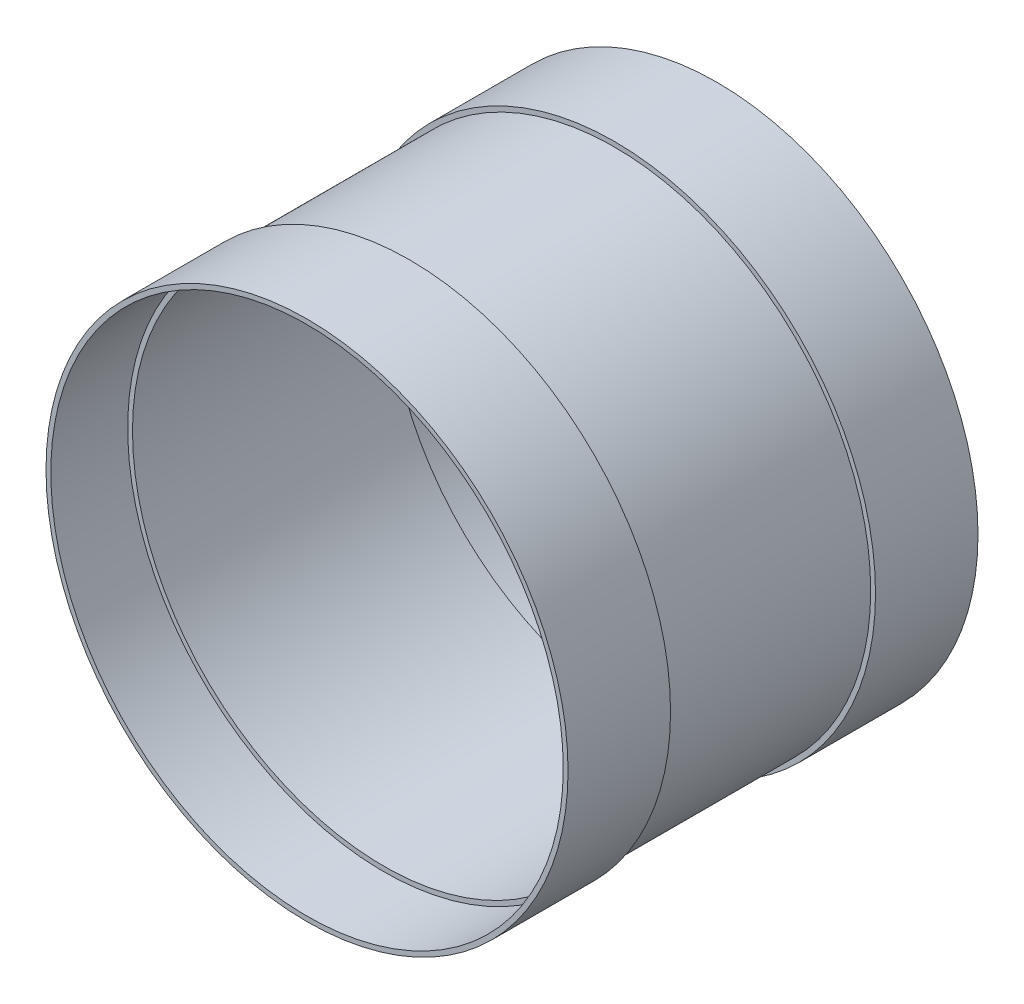
ISO-10303-21;
HEADER;
FILE_DESCRIPTION(('STEP AP214'),'2;1');
FILE_NAME('part.step','',(''),(''),'','','');
FILE_SCHEMA(('AUTOMOTIVE_DESIGN { 1 0 10303 214 1 1 1 1 }'));
ENDSEC;
DATA;
#1=APPLICATION_CONTEXT('core data for automotive mechanical design processes');
#2=APPLICATION_PROTOCOL_DEFINITION('international standard','automotive_design',2000,#1);
#3=PRODUCT_CONTEXT('',#1,'mechanical');
#4=PRODUCT('Part','Part','',(#3));
#5=PRODUCT_RELATED_PRODUCT_CATEGORY('part','',(#4));
#6=PRODUCT_DEFINITION_FORMATION('','',#4);
#7=PRODUCT_DEFINITION_CONTEXT('part definition',#1,'design');
#8=PRODUCT_DEFINITION('design','',#6,#7);
#9=PRODUCT_DEFINITION_SHAPE('','',#8);
#10=(LENGTH_UNIT() NAMED_UNIT(*) SI_UNIT(.MILLI.,.METRE.));
#11=(NAMED_UNIT(*) PLANE_ANGLE_UNIT() SI_UNIT($,.RADIAN.));
#12=(NAMED_UNIT(*) SI_UNIT($,.STERADIAN.) SOLID_ANGLE_UNIT());
#13=UNCERTAINTY_MEASURE_WITH_UNIT(LENGTH_MEASURE(1.E-05),#10,'distance_accuracy_value','');
#14=(GEOMETRIC_REPRESENTATION_CONTEXT(3) GLOBAL_UNCERTAINTY_ASSIGNED_CONTEXT((#13)) GLOBAL_UNIT_ASSIGNED_CONTEXT((#10,
#11,#12)) REPRESENTATION_CONTEXT('',''));
#15=CARTESIAN_POINT('',(0.,0.,0.));
#16=DIRECTION('',(0.,0.,1.));
#17=DIRECTION('',(1.,0.,0.));
#18=AXIS2_PLACEMENT_3D('',#15,#16,#17);
#19=CARTESIAN_POINT('',(0.,249.2375,127.));
#20=DIRECTION('',(0.,0.,-1.));
#21=DIRECTION('',(-1.,0.,0.));
#22=AXIS2_PLACEMENT_3D('',#19,#20,#21);
#23=PLANE('',#22);
#24=CARTESIAN_POINT('',(0.,0.,127.));
#25=DIRECTION('',(0.,0.,1.));
#26=DIRECTION('',(1.,0.,0.));
#27=AXIS2_PLACEMENT_3D('',#24,#25,#26);
#28=CIRCLE('',#27,249.2375);
#29=CARTESIAN_POINT('',(249.2375,0.,127.));
#30=VERTEX_POINT('',#29);
#31=EDGE_CURVE('E73',#30,#30,#28,.T.);
#32=ORIENTED_EDGE('',*,*,#31,.F.);
#33=EDGE_LOOP('',(#32));
#34=FACE_BOUND('',#33,.T.);
#35=CARTESIAN_POINT('',(0.,0.,127.));
#36=DIRECTION('',(0.,0.,1.));
#37=DIRECTION('',(1.,0.,0.));
#38=AXIS2_PLACEMENT_3D('',#35,#36,#37);
#39=CIRCLE('',#38,254.);
#40=CARTESIAN_POINT('',(254.,0.,127.));
#41=VERTEX_POINT('',#40);
#42=EDGE_CURVE('E11',#41,#41,#39,.T.);
#43=ORIENTED_EDGE('',*,*,#42,.T.);
#44=EDGE_LOOP('',(#43));
#45=FACE_BOUND('',#44,.T.);
#46=ADVANCED_FACE('F52',(#34,#45),#23,.F.);
#47=CARTESIAN_POINT('',(0.,0.,0.));
#48=DIRECTION('',(0.,0.,1.));
#49=DIRECTION('',(1.,0.,0.));
#50=AXIS2_PLACEMENT_3D('',#47,#48,#49);
#51=CYLINDRICAL_SURFACE('',#50,254.);
#52=ORIENTED_EDGE('',*,*,#42,.F.);
#53=EDGE_LOOP('',(#52));
#54=FACE_BOUND('',#53,.T.);
#55=CARTESIAN_POINT('',(0.,0.,-127.));
#56=DIRECTION('',(0.,0.,1.));
#57=DIRECTION('',(1.,0.,0.));
#58=AXIS2_PLACEMENT_3D('',#55,#56,#57);
#59=CIRCLE('',#58,254.);
#60=CARTESIAN_POINT('',(254.,0.,-127.));
#61=VERTEX_POINT('',#60);
#62=EDGE_CURVE('E59',#61,#61,#59,.T.);
#63=ORIENTED_EDGE('',*,*,#62,.T.);
#64=EDGE_LOOP('',(#63));
#65=FACE_BOUND('',#64,.T.);
#66=ADVANCED_FACE('F85',(#54,#65),#51,.T.);
#67=CARTESIAN_POINT('',(0.,249.2375,-127.));
#68=DIRECTION('',(0.,0.,1.));
#69=DIRECTION('',(1.,0.,0.));
#70=AXIS2_PLACEMENT_3D('',#67,#68,#69);
#71=PLANE('',#70);
#72=ORIENTED_EDGE('',*,*,#62,.F.);
#73=EDGE_LOOP('',(#72));
#74=FACE_BOUND('',#73,.T.);
#75=CARTESIAN_POINT('',(0.,0.,-127.));
#76=DIRECTION('',(0.,0.,1.));
#77=DIRECTION('',(1.,0.,0.));
#78=AXIS2_PLACEMENT_3D('',#75,#76,#77);
#79=CIRCLE('',#78,249.2375);
#80=CARTESIAN_POINT('',(249.2375,0.,-127.));
#81=VERTEX_POINT('',#80);
#82=EDGE_CURVE('E66',#81,#81,#79,.T.);
#83=ORIENTED_EDGE('',*,*,#82,.T.);
#84=EDGE_LOOP('',(#83));
#85=FACE_BOUND('',#84,.T.);
#86=ADVANCED_FACE('F89',(#74,#85),#71,.F.);
#87=CARTESIAN_POINT('',(0.,0.,0.));
#88=DIRECTION('',(0.,0.,1.));
#89=DIRECTION('',(1.,0.,0.));
#90=AXIS2_PLACEMENT_3D('',#87,#88,#89);
#91=CYLINDRICAL_SURFACE('',#90,249.2375);
#92=ORIENTED_EDGE('',*,*,#82,.F.);
#93=EDGE_LOOP('',(#92));
#94=FACE_BOUND('',#93,.T.);
#95=ORIENTED_EDGE('',*,*,#31,.T.);
#96=EDGE_LOOP('',(#95));
#97=FACE_BOUND('',#96,.T.);
#98=ADVANCED_FACE('F82',(#94,#97),#91,.F.);
#99=CLOSED_SHELL('',(#46,#66,#86,#98));
#100=MANIFOLD_SOLID_BREP('B2',#99);
#101=CARTESIAN_POINT('',(0.,258.7625,-101.6));
#102=DIRECTION('',(0.,0.,-1.));
#103=DIRECTION('',(-1.,0.,0.));
#104=AXIS2_PLACEMENT_3D('',#101,#102,#103);
#105=PLANE('',#104);
#106=CARTESIAN_POINT('',(0.,0.,-101.6));
#107=DIRECTION('',(0.,0.,1.));
#108=DIRECTION('',(1.,0.,0.));
#109=AXIS2_PLACEMENT_3D('',#106,#107,#108);
#110=CIRCLE('',#109,254.);
#111=CARTESIAN_POINT('',(254.,0.,-101.6));
#112=VERTEX_POINT('',#111);
#113=EDGE_CURVE('E51',#112,#112,#110,.T.);
#114=ORIENTED_EDGE('',*,*,#113,.F.);
#115=EDGE_LOOP('',(#114));
#116=FACE_BOUND('',#115,.T.);
#117=CARTESIAN_POINT('',(0.,0.,-101.6));
#118=DIRECTION('',(0.,0.,1.));
#119=DIRECTION('',(1.,0.,0.));
#120=AXIS2_PLACEMENT_3D('',#117,#118,#119);
#121=CIRCLE('',#120,258.7625);
#122=CARTESIAN_POINT('',(258.7625,0.,-101.6));
#123=VERTEX_POINT('',#122);
#124=EDGE_CURVE('E160',#123,#123,#121,.T.);
#125=ORIENTED_EDGE('',*,*,#124,.T.);
#126=EDGE_LOOP('',(#125));
#127=FACE_BOUND('',#126,.T.);
#128=ADVANCED_FACE('F141',(#116,#127),#105,.F.);
#129=CARTESIAN_POINT('',(0.,0.,62.5945817490495));
#130=DIRECTION('',(0.,0.,1.));
#131=DIRECTION('',(1.,0.,0.));
#132=AXIS2_PLACEMENT_3D('',#129,#130,#131);
#133=CYLINDRICAL_SURFACE('',#132,254.);
#134=CARTESIAN_POINT('',(0.,0.,-203.2));
#135=DIRECTION('',(0.,0.,1.));
#136=DIRECTION('',(1.,0.,0.));
#137=AXIS2_PLACEMENT_3D('',#134,#135,#136);
#138=CIRCLE('',#137,254.);
#139=CARTESIAN_POINT('',(254.,0.,-203.2));
#140=VERTEX_POINT('',#139);
#141=EDGE_CURVE('E148',#140,#140,#138,.T.);
#142=ORIENTED_EDGE('',*,*,#141,.F.);
#143=EDGE_LOOP('',(#142));
#144=FACE_BOUND('',#143,.T.);
#145=ORIENTED_EDGE('',*,*,#113,.T.);
#146=EDGE_LOOP('',(#145));
#147=FACE_BOUND('',#146,.T.);
#148=ADVANCED_FACE('F177',(#144,#147),#133,.F.);
#149=CARTESIAN_POINT('',(0.,258.7625,-203.2));
#150=DIRECTION('',(0.,0.,1.));
#151=DIRECTION('',(1.,0.,0.));
#152=AXIS2_PLACEMENT_3D('',#149,#150,#151);
#153=PLANE('',#152);
#154=CARTESIAN_POINT('',(0.,0.,-203.2));
#155=DIRECTION('',(0.,0.,1.));
#156=DIRECTION('',(1.,0.,0.));
#157=AXIS2_PLACEMENT_3D('',#154,#155,#156);
#158=CIRCLE('',#157,258.7625);
#159=CARTESIAN_POINT('',(258.7625,0.,-203.2));
#160=VERTEX_POINT('',#159);
#161=EDGE_CURVE('E154',#160,#160,#158,.T.);
#162=ORIENTED_EDGE('',*,*,#161,.F.);
#163=EDGE_LOOP('',(#162));
#164=FACE_BOUND('',#163,.T.);
#165=ORIENTED_EDGE('',*,*,#141,.T.);
#166=EDGE_LOOP('',(#165));
#167=FACE_BOUND('',#166,.T.);
#168=ADVANCED_FACE('F172',(#164,#167),#153,.F.);
#169=CARTESIAN_POINT('',(0.,0.,62.5945817490495));
#170=DIRECTION('',(0.,0.,1.));
#171=DIRECTION('',(1.,0.,0.));
#172=AXIS2_PLACEMENT_3D('',#169,#170,#171);
#173=CYLINDRICAL_SURFACE('',#172,258.7625);
#174=ORIENTED_EDGE('',*,*,#124,.F.);
#175=EDGE_LOOP('',(#174));
#176=FACE_BOUND('',#175,.T.);
#177=ORIENTED_EDGE('',*,*,#161,.T.);
#178=EDGE_LOOP('',(#177));
#179=FACE_BOUND('',#178,.T.);
#180=ADVANCED_FACE('F169',(#176,#179),#173,.T.);
#181=CLOSED_SHELL('',(#128,#148,#168,#180));
#182=MANIFOLD_SOLID_BREP('B6',#181);
#183=CARTESIAN_POINT('',(0.,254.,203.2));
#184=DIRECTION('',(0.,0.,-1.));
#185=DIRECTION('',(-1.,0.,0.));
#186=AXIS2_PLACEMENT_3D('',#183,#184,#185);
#187=PLANE('',#186);
#188=CARTESIAN_POINT('',(0.,0.,203.2));
#189=DIRECTION('',(0.,0.,1.));
#190=DIRECTION('',(1.,0.,0.));
#191=AXIS2_PLACEMENT_3D('',#188,#189,#190);
#192=CIRCLE('',#191,254.);
#193=CARTESIAN_POINT('',(254.,0.,203.2));
#194=VERTEX_POINT('',#193);
#195=EDGE_CURVE('E238',#194,#194,#192,.T.);
#196=ORIENTED_EDGE('',*,*,#195,.F.);
#197=EDGE_LOOP('',(#196));
#198=FACE_BOUND('',#197,.T.);
#199=CARTESIAN_POINT('',(0.,0.,203.2));
#200=DIRECTION('',(0.,0.,1.));
#201=DIRECTION('',(1.,0.,0.));
#202=AXIS2_PLACEMENT_3D('',#199,#200,#201);
#203=CIRCLE('',#202,258.7625);
#204=CARTESIAN_POINT('',(258.7625,0.,203.2));
#205=VERTEX_POINT('',#204);
#206=EDGE_CURVE('E140',#205,#205,#203,.T.);
#207=ORIENTED_EDGE('',*,*,#206,.T.);
#208=EDGE_LOOP('',(#207));
#209=FACE_BOUND('',#208,.T.);
#210=ADVANCED_FACE('F219',(#198,#209),#187,.F.);
#211=CARTESIAN_POINT('',(0.,0.,62.5945817490495));
#212=DIRECTION('',(0.,0.,1.));
#213=DIRECTION('',(1.,0.,0.));
#214=AXIS2_PLACEMENT_3D('',#211,#212,#213);
#215=CYLINDRICAL_SURFACE('',#214,258.7625);
#216=ORIENTED_EDGE('',*,*,#206,.F.);
#217=EDGE_LOOP('',(#216));
#218=FACE_BOUND('',#217,.T.);
#219=CARTESIAN_POINT('',(0.,0.,101.6));
#220=DIRECTION('',(0.,0.,1.));
#221=DIRECTION('',(1.,0.,0.));
#222=AXIS2_PLACEMENT_3D('',#219,#220,#221);
#223=CIRCLE('',#222,258.7625);
#224=CARTESIAN_POINT('',(258.7625,0.,101.6));
#225=VERTEX_POINT('',#224);
#226=EDGE_CURVE('E226',#225,#225,#223,.T.);
#227=ORIENTED_EDGE('',*,*,#226,.T.);
#228=EDGE_LOOP('',(#227));
#229=FACE_BOUND('',#228,.T.);
#230=ADVANCED_FACE('F249',(#218,#229),#215,.T.);
#231=CARTESIAN_POINT('',(0.,258.7625,101.6));
#232=DIRECTION('',(0.,0.,1.));
#233=DIRECTION('',(1.,0.,0.));
#234=AXIS2_PLACEMENT_3D('',#231,#232,#233);
#235=PLANE('',#234);
#236=ORIENTED_EDGE('',*,*,#226,.F.);
#237=EDGE_LOOP('',(#236));
#238=FACE_BOUND('',#237,.T.);
#239=CARTESIAN_POINT('',(0.,0.,101.6));
#240=DIRECTION('',(0.,0.,1.));
#241=DIRECTION('',(1.,0.,0.));
#242=AXIS2_PLACEMENT_3D('',#239,#240,#241);
#243=CIRCLE('',#242,254.);
#244=CARTESIAN_POINT('',(254.,0.,101.6));
#245=VERTEX_POINT('',#244);
#246=EDGE_CURVE('E232',#245,#245,#243,.T.);
#247=ORIENTED_EDGE('',*,*,#246,.T.);
#248=EDGE_LOOP('',(#247));
#249=FACE_BOUND('',#248,.T.);
#250=ADVANCED_FACE('F253',(#238,#249),#235,.F.);
#251=CARTESIAN_POINT('',(0.,0.,62.5945817490495));
#252=DIRECTION('',(0.,0.,1.));
#253=DIRECTION('',(1.,0.,0.));
#254=AXIS2_PLACEMENT_3D('',#251,#252,#253);
#255=CYLINDRICAL_SURFACE('',#254,254.);
#256=ORIENTED_EDGE('',*,*,#246,.F.);
#257=EDGE_LOOP('',(#256));
#258=FACE_BOUND('',#257,.T.);
#259=ORIENTED_EDGE('',*,*,#195,.T.);
#260=EDGE_LOOP('',(#259));
#261=FACE_BOUND('',#260,.T.);
#262=ADVANCED_FACE('F246',(#258,#261),#255,.F.);
#263=CLOSED_SHELL('',(#210,#230,#250,#262));
#264=MANIFOLD_SOLID_BREP('B46',#263);
#265=ADVANCED_BREP_SHAPE_REPRESENTATION('',(#18,#100,#182,#264),#14);
#266=SHAPE_DEFINITION_REPRESENTATION(#9,#265);
ENDSEC;
END-ISO-10303-21;
